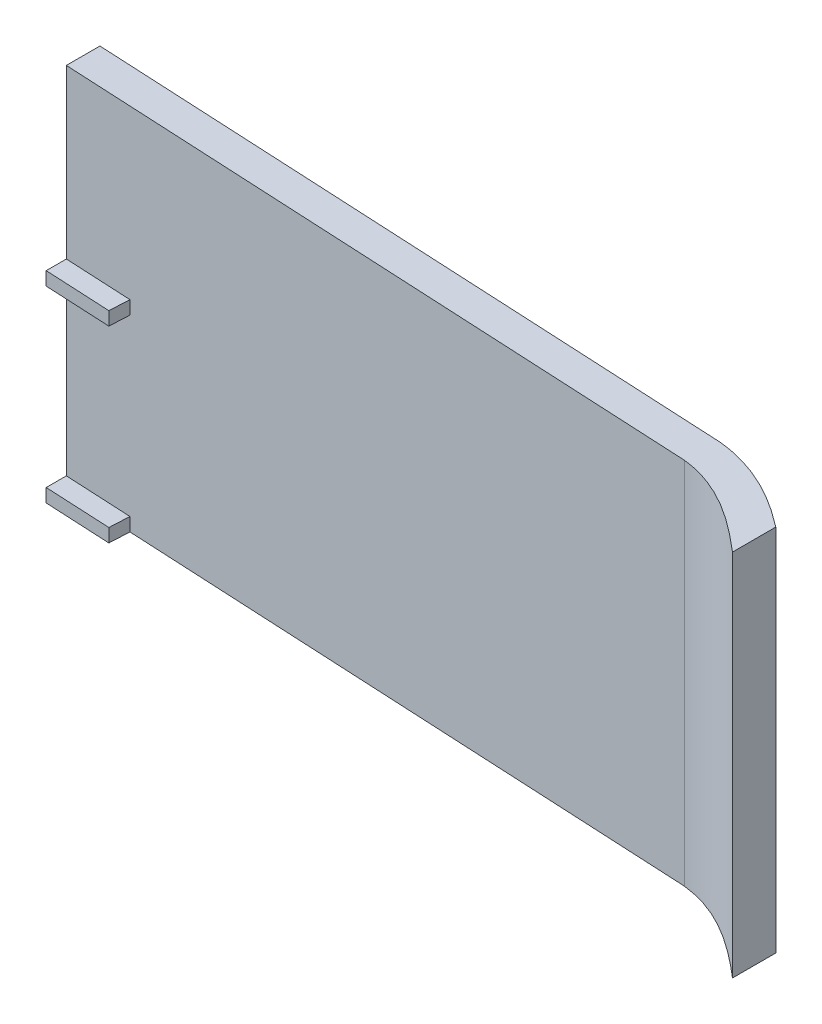
ISO-10303-21;
HEADER;
FILE_DESCRIPTION(('STEP AP214'),'2;1');
FILE_NAME('part.step','',(''),(''),'','','');
FILE_SCHEMA(('AUTOMOTIVE_DESIGN { 1 0 10303 214 1 1 1 1 }'));
ENDSEC;
DATA;
#1=APPLICATION_CONTEXT('core data for automotive mechanical design processes');
#2=APPLICATION_PROTOCOL_DEFINITION('international standard','automotive_design',2000,#1);
#3=PRODUCT_CONTEXT('',#1,'mechanical');
#4=PRODUCT('Part','Part','',(#3));
#5=PRODUCT_RELATED_PRODUCT_CATEGORY('part','',(#4));
#6=PRODUCT_DEFINITION_FORMATION('','',#4);
#7=PRODUCT_DEFINITION_CONTEXT('part definition',#1,'design');
#8=PRODUCT_DEFINITION('design','',#6,#7);
#9=PRODUCT_DEFINITION_SHAPE('','',#8);
#10=(LENGTH_UNIT() NAMED_UNIT(*) SI_UNIT(.MILLI.,.METRE.));
#11=(NAMED_UNIT(*) PLANE_ANGLE_UNIT() SI_UNIT($,.RADIAN.));
#12=(NAMED_UNIT(*) SI_UNIT($,.STERADIAN.) SOLID_ANGLE_UNIT());
#13=UNCERTAINTY_MEASURE_WITH_UNIT(LENGTH_MEASURE(1.E-05),#10,'distance_accuracy_value','');
#14=(GEOMETRIC_REPRESENTATION_CONTEXT(3) GLOBAL_UNCERTAINTY_ASSIGNED_CONTEXT((#13)) GLOBAL_UNIT_ASSIGNED_CONTEXT((#10,
#11,#12)) REPRESENTATION_CONTEXT('',''));
#15=CARTESIAN_POINT('',(0.,0.,0.));
#16=DIRECTION('',(0.,0.,1.));
#17=DIRECTION('',(1.,0.,0.));
#18=AXIS2_PLACEMENT_3D('',#15,#16,#17);
#19=CARTESIAN_POINT('',(15.2026066350711,-55.02,-53.3815975655058));
#20=DIRECTION('',(-1.,0.,0.));
#21=DIRECTION('',(0.,0.,1.));
#22=AXIS2_PLACEMENT_3D('',#19,#20,#21);
#23=PLANE('',#22);
#24=DIRECTION('',(0.,0.,-1.));
#25=VECTOR('',#24,1.);
#26=CARTESIAN_POINT('',(15.2026066350711,-55.,32.5431279620853));
#27=LINE('',#26,#25);
#28=CARTESIAN_POINT('',(15.2026066350711,-55.,-45.3713854986732));
#29=VERTEX_POINT('',#28);
#30=CARTESIAN_POINT('',(15.2026066350711,-55.,-53.3815975655058));
#31=VERTEX_POINT('',#30);
#32=EDGE_CURVE('E197',#29,#31,#27,.T.);
#33=ORIENTED_EDGE('',*,*,#32,.F.);
#34=DIRECTION('',(0.,-1.,0.));
#35=VECTOR('',#34,1.);
#36=CARTESIAN_POINT('',(15.2026066350711,0.,-45.3713854986732));
#37=LINE('',#36,#35);
#38=CARTESIAN_POINT('',(15.2026066350711,-53.,-45.3713854986732));
#39=VERTEX_POINT('',#38);
#40=EDGE_CURVE('E194',#39,#29,#37,.T.);
#41=ORIENTED_EDGE('',*,*,#40,.F.);
#42=DIRECTION('',(0.,0.,1.));
#43=VECTOR('',#42,1.);
#44=CARTESIAN_POINT('',(15.2026066350711,-53.,-46.0222081076461));
#45=LINE('',#44,#43);
#46=CARTESIAN_POINT('',(15.2026066350711,-53.,-48.3752150237354));
#47=VERTEX_POINT('',#46);
#48=EDGE_CURVE('E151',#47,#39,#45,.T.);
#49=ORIENTED_EDGE('',*,*,#48,.F.);
#50=DIRECTION('',(0.,1.,0.));
#51=VECTOR('',#50,1.);
#52=CARTESIAN_POINT('',(15.2026066350711,-55.,-48.3752150237354));
#53=LINE('',#52,#51);
#54=CARTESIAN_POINT('',(15.2026066350711,-27.,-48.3752150237354));
#55=VERTEX_POINT('',#54);
#56=EDGE_CURVE('E135',#47,#55,#53,.T.);
#57=ORIENTED_EDGE('',*,*,#56,.T.);
#58=DIRECTION('',(0.,0.,1.));
#59=VECTOR('',#58,1.);
#60=CARTESIAN_POINT('',(15.2026066350711,-27.,-46.0222081076461));
#61=LINE('',#60,#59);
#62=CARTESIAN_POINT('',(15.2026066350711,-27.,-45.3713854986732));
#63=VERTEX_POINT('',#62);
#64=EDGE_CURVE('E148',#55,#63,#61,.T.);
#65=ORIENTED_EDGE('',*,*,#64,.T.);
#66=DIRECTION('',(0.,-1.,0.));
#67=VECTOR('',#66,1.);
#68=CARTESIAN_POINT('',(15.2026066350711,0.,-45.3713854986732));
#69=LINE('',#68,#67);
#70=CARTESIAN_POINT('',(15.2026066350711,-25.,-45.3713854986732));
#71=VERTEX_POINT('',#70);
#72=EDGE_CURVE('E165',#71,#63,#69,.T.);
#73=ORIENTED_EDGE('',*,*,#72,.F.);
#74=DIRECTION('',(0.,0.,1.));
#75=VECTOR('',#74,1.);
#76=CARTESIAN_POINT('',(15.2026066350711,-25.,-46.0222081076461));
#77=LINE('',#76,#75);
#78=CARTESIAN_POINT('',(15.2026066350711,-25.,-48.3752150237354));
#79=VERTEX_POINT('',#78);
#80=EDGE_CURVE('E192',#79,#71,#77,.T.);
#81=ORIENTED_EDGE('',*,*,#80,.F.);
#82=CARTESIAN_POINT('',(15.2026066350711,0.,-48.3752150237354));
#83=VERTEX_POINT('',#82);
#84=EDGE_CURVE('E153',#79,#83,#53,.T.);
#85=ORIENTED_EDGE('',*,*,#84,.T.);
#86=DIRECTION('',(0.,0.,-1.));
#87=VECTOR('',#86,1.);
#88=CARTESIAN_POINT('',(15.2026066350711,0.,32.5431279620853));
#89=LINE('',#88,#87);
#90=CARTESIAN_POINT('',(15.2026066350711,0.,-53.3815975655058));
#91=VERTEX_POINT('',#90);
#92=EDGE_CURVE('E157',#83,#91,#89,.T.);
#93=ORIENTED_EDGE('',*,*,#92,.T.);
#94=DIRECTION('',(0.,1.,0.));
#95=VECTOR('',#94,1.);
#96=CARTESIAN_POINT('',(15.2026066350711,-55.,-53.3815975655058));
#97=LINE('',#96,#95);
#98=EDGE_CURVE('E152',#31,#91,#97,.T.);
#99=ORIENTED_EDGE('',*,*,#98,.F.);
#100=EDGE_LOOP('',(#33,#41,#49,#57,#65,#73,#81,#85,#93,#99));
#101=FACE_BOUND('',#100,.T.);
#102=ADVANCED_FACE('F37',(#101),#23,.T.);
#103=CARTESIAN_POINT('',(-77.2973933649289,-55.,-58.0568720379147));
#104=DIRECTION('',(0.0504790708541746,0.,-0.998725119042121));
#105=DIRECTION('',(-0.998725119042121,0.,-0.0504790708541746));
#106=AXIS2_PLACEMENT_3D('',#103,#104,#105);
#107=PLANE('',#106);
#108=DIRECTION('',(-0.998725119042121,0.,-0.0504790708541746));
#109=VECTOR('',#108,1.);
#110=CARTESIAN_POINT('',(-77.2973933649289,-55.,-58.0568720379147));
#111=LINE('',#110,#109);
#112=CARTESIAN_POINT('',(112.637979465165,-55.,-48.4568720379147));
#113=VERTEX_POINT('',#112);
#114=EDGE_CURVE('E166',#113,#31,#111,.T.);
#115=ORIENTED_EDGE('',*,*,#114,.T.);
#116=ORIENTED_EDGE('',*,*,#98,.T.);
#117=DIRECTION('',(-0.998725119042121,0.,-0.0504790708541746));
#118=VECTOR('',#117,1.);
#119=CARTESIAN_POINT('',(-77.2973933649289,0.,-58.0568720379147));
#120=LINE('',#119,#118);
#121=CARTESIAN_POINT('',(112.637979465165,0.,-48.4568720379147));
#122=VERTEX_POINT('',#121);
#123=EDGE_CURVE('E171',#122,#91,#120,.T.);
#124=ORIENTED_EDGE('',*,*,#123,.F.);
#125=DIRECTION('',(0.,1.,0.));
#126=VECTOR('',#125,1.);
#127=CARTESIAN_POINT('',(112.637979465165,-55.,-48.4568720379147));
#128=LINE('',#127,#126);
#129=EDGE_CURVE('E170',#113,#122,#128,.T.);
#130=ORIENTED_EDGE('',*,*,#129,.F.);
#131=EDGE_LOOP('',(#115,#116,#124,#130));
#132=FACE_BOUND('',#131,.T.);
#133=ADVANCED_FACE('F214',(#132),#107,.T.);
#134=CARTESIAN_POINT('',(142.702606635071,-55.,-29.0568720379147));
#135=CARTESIAN_POINT('',(133.287763268237,-55.,-35.7757587441815));
#136=CARTESIAN_POINT('',(125.082628435847,-55.,-47.1414686898549));
#137=CARTESIAN_POINT('',(112.637979465165,-55.,-48.4568720379147));
#138=B_SPLINE_CURVE_WITH_KNOTS('',3,(#134,#135,#136,#137),.UNSPECIFIED.,.F.,.F.,(4,4),(0.,1.),.UNSPECIFIED.);
#139=DIRECTION('',(0.,1.,0.));
#140=VECTOR('',#139,1.);
#141=SURFACE_OF_LINEAR_EXTRUSION('',#138,#140);
#142=DIRECTION('',(0.,1.,0.));
#143=VECTOR('',#142,1.);
#144=CARTESIAN_POINT('',(127.702606635071,-55.,-41.6523536542947));
#145=LINE('',#144,#143);
#146=CARTESIAN_POINT('',(127.702606635071,-55.,-41.6523536542947));
#147=VERTEX_POINT('',#146);
#148=CARTESIAN_POINT('',(127.702606630983,0.,-41.6523536574432));
#149=VERTEX_POINT('',#148);
#150=EDGE_CURVE('E164',#147,#149,#145,.T.);
#151=ORIENTED_EDGE('',*,*,#150,.F.);
#152=EDGE_CURVE('E169',#147,#113,#138,.T.);
#153=ORIENTED_EDGE('',*,*,#152,.T.);
#154=ORIENTED_EDGE('',*,*,#129,.T.);
#155=CARTESIAN_POINT('',(142.702606635071,0.,-29.0568720379147));
#156=CARTESIAN_POINT('',(133.287763268237,0.,-35.7757587441815));
#157=CARTESIAN_POINT('',(125.082628435847,0.,-47.1414686898549));
#158=CARTESIAN_POINT('',(112.637979465165,0.,-48.4568720379147));
#159=B_SPLINE_CURVE_WITH_KNOTS('',3,(#155,#156,#157,#158),.UNSPECIFIED.,.F.,.F.,(4,4),(0.,1.),.UNSPECIFIED.);
#160=EDGE_CURVE('E173',#149,#122,#159,.T.);
#161=ORIENTED_EDGE('',*,*,#160,.F.);
#162=EDGE_LOOP('',(#151,#153,#154,#161));
#163=FACE_BOUND('',#162,.T.);
#164=ADVANCED_FACE('F275',(#163),#141,.T.);
#165=CARTESIAN_POINT('',(112.240105598559,-55.,-43.4705994370284));
#166=DIRECTION('',(0.0504790708541747,0.,-0.998725119042121));
#167=DIRECTION('',(-0.998725119042121,0.,-0.0504790708541747));
#168=AXIS2_PLACEMENT_3D('',#165,#166,#167);
#169=PLANE('',#168);
#170=ORIENTED_EDGE('',*,*,#56,.F.);
#171=DIRECTION('',(0.998725119042121,0.,0.0504790708541747));
#172=VECTOR('',#171,1.);
#173=CARTESIAN_POINT('',(112.240105598559,-53.,-43.4705994370284));
#174=LINE('',#173,#172);
#175=CARTESIAN_POINT('',(25.1898578254923,-53.,-47.8704243151937));
#176=VERTEX_POINT('',#175);
#177=EDGE_CURVE('E162',#47,#176,#174,.T.);
#178=ORIENTED_EDGE('',*,*,#177,.T.);
#179=DIRECTION('',(0.,-1.,0.));
#180=VECTOR('',#179,1.);
#181=CARTESIAN_POINT('',(25.1898578254923,0.,-47.8704243151937));
#182=LINE('',#181,#180);
#183=CARTESIAN_POINT('',(25.1898578254923,-55.,-47.8704243151937));
#184=VERTEX_POINT('',#183);
#185=EDGE_CURVE('E143',#176,#184,#182,.T.);
#186=ORIENTED_EDGE('',*,*,#185,.T.);
#187=DIRECTION('',(-0.998725119042121,0.,-0.0504790708541747));
#188=VECTOR('',#187,1.);
#189=CARTESIAN_POINT('',(112.240105598559,-55.,-43.4705994370284));
#190=LINE('',#189,#188);
#191=CARTESIAN_POINT('',(112.240105598559,-55.,-43.4705994370284));
#192=VERTEX_POINT('',#191);
#193=EDGE_CURVE('E241',#192,#184,#190,.T.);
#194=ORIENTED_EDGE('',*,*,#193,.F.);
#195=DIRECTION('',(0.,1.,0.));
#196=VECTOR('',#195,1.);
#197=CARTESIAN_POINT('',(112.240105598559,-55.,-43.4705994370284));
#198=LINE('',#197,#196);
#199=CARTESIAN_POINT('',(112.240105598559,0.,-43.4705994370284));
#200=VERTEX_POINT('',#199);
#201=EDGE_CURVE('E248',#192,#200,#198,.T.);
#202=ORIENTED_EDGE('',*,*,#201,.T.);
#203=DIRECTION('',(-0.998725119042121,0.,-0.0504790708541747));
#204=VECTOR('',#203,1.);
#205=CARTESIAN_POINT('',(112.240105598559,0.,-43.4705994370284));
#206=LINE('',#205,#204);
#207=EDGE_CURVE('E208',#200,#83,#206,.T.);
#208=ORIENTED_EDGE('',*,*,#207,.T.);
#209=ORIENTED_EDGE('',*,*,#84,.F.);
#210=DIRECTION('',(0.998725119042121,0.,0.0504790708541744));
#211=VECTOR('',#210,1.);
#212=CARTESIAN_POINT('',(5.21535544464988,-25.,-48.8800057322772));
#213=LINE('',#212,#211);
#214=CARTESIAN_POINT('',(25.1898578254923,-25.,-47.8704243151937));
#215=VERTEX_POINT('',#214);
#216=EDGE_CURVE('E179',#79,#215,#213,.T.);
#217=ORIENTED_EDGE('',*,*,#216,.T.);
#218=DIRECTION('',(0.,-1.,0.));
#219=VECTOR('',#218,1.);
#220=CARTESIAN_POINT('',(25.1898578254923,-25.,-47.8704243151937));
#221=LINE('',#220,#219);
#222=CARTESIAN_POINT('',(25.1898578254923,-27.,-47.8704243151937));
#223=VERTEX_POINT('',#222);
#224=EDGE_CURVE('E139',#215,#223,#221,.T.);
#225=ORIENTED_EDGE('',*,*,#224,.T.);
#226=DIRECTION('',(0.998725119042121,0.,0.0504790708541744));
#227=VECTOR('',#226,1.);
#228=CARTESIAN_POINT('',(5.21535544464988,-27.,-48.8800057322772));
#229=LINE('',#228,#227);
#230=EDGE_CURVE('E132',#55,#223,#229,.T.);
#231=ORIENTED_EDGE('',*,*,#230,.F.);
#232=EDGE_LOOP('',(#170,#178,#186,#194,#202,#208,#209,#217,#225,#231));
#233=FACE_BOUND('',#232,.T.);
#234=ADVANCED_FACE('F134',(#233),#169,.F.);
#235=CARTESIAN_POINT('',(25.0384206129298,-25.,-44.8742489580673));
#236=DIRECTION('',(0.998725119042121,0.,0.0504790708541747));
#237=DIRECTION('',(0.0504790708541747,0.,-0.998725119042121));
#238=AXIS2_PLACEMENT_3D('',#235,#236,#237);
#239=PLANE('',#238);
#240=ORIENTED_EDGE('',*,*,#224,.F.);
#241=DIRECTION('',(0.0504790708541747,0.,-0.998725119042121));
#242=VECTOR('',#241,1.);
#243=CARTESIAN_POINT('',(25.0384206129298,-25.,-44.8742489580673));
#244=LINE('',#243,#242);
#245=CARTESIAN_POINT('',(25.0384206129298,-25.,-44.8742489580673));
#246=VERTEX_POINT('',#245);
#247=EDGE_CURVE('E48',#246,#215,#244,.T.);
#248=ORIENTED_EDGE('',*,*,#247,.F.);
#249=DIRECTION('',(0.,-1.,0.));
#250=VECTOR('',#249,1.);
#251=CARTESIAN_POINT('',(25.0384206129298,-25.,-44.8742489580673));
#252=LINE('',#251,#250);
#253=CARTESIAN_POINT('',(25.0384206129298,-27.,-44.8742489580673));
#254=VERTEX_POINT('',#253);
#255=EDGE_CURVE('E181',#246,#254,#252,.T.);
#256=ORIENTED_EDGE('',*,*,#255,.T.);
#257=DIRECTION('',(0.0504790708541747,0.,-0.998725119042121));
#258=VECTOR('',#257,1.);
#259=CARTESIAN_POINT('',(25.0384206129298,-27.,-44.8742489580673));
#260=LINE('',#259,#258);
#261=EDGE_CURVE('E11',#254,#223,#260,.T.);
#262=ORIENTED_EDGE('',*,*,#261,.T.);
#263=EDGE_LOOP('',(#240,#248,#256,#262));
#264=FACE_BOUND('',#263,.T.);
#265=ADVANCED_FACE('F349',(#264),#239,.T.);
#266=CARTESIAN_POINT('',(2.32612383491424,-27.,-46.0222081076461));
#267=DIRECTION('',(0.,1.,0.));
#268=DIRECTION('',(0.,0.,1.));
#269=AXIS2_PLACEMENT_3D('',#266,#267,#268);
#270=PLANE('',#269);
#271=ORIENTED_EDGE('',*,*,#64,.F.);
#272=ORIENTED_EDGE('',*,*,#230,.T.);
#273=ORIENTED_EDGE('',*,*,#261,.F.);
#274=DIRECTION('',(0.998725119042121,0.,0.0504790708541744));
#275=VECTOR('',#274,1.);
#276=CARTESIAN_POINT('',(5.06391823208736,-27.,-45.8838303751508));
#277=LINE('',#276,#275);
#278=EDGE_CURVE('E156',#63,#254,#277,.T.);
#279=ORIENTED_EDGE('',*,*,#278,.F.);
#280=EDGE_LOOP('',(#271,#272,#273,#279));
#281=FACE_BOUND('',#280,.T.);
#282=ADVANCED_FACE('F155',(#281),#270,.F.);
#283=CARTESIAN_POINT('',(2.32612383491424,-25.,-46.0222081076461));
#284=DIRECTION('',(0.,1.,0.));
#285=DIRECTION('',(0.,0.,1.));
#286=AXIS2_PLACEMENT_3D('',#283,#284,#285);
#287=PLANE('',#286);
#288=ORIENTED_EDGE('',*,*,#216,.F.);
#289=ORIENTED_EDGE('',*,*,#80,.T.);
#290=DIRECTION('',(0.998725119042121,0.,0.0504790708541744));
#291=VECTOR('',#290,1.);
#292=CARTESIAN_POINT('',(5.06391823208735,-25.,-45.8838303751508));
#293=LINE('',#292,#291);
#294=EDGE_CURVE('E56',#71,#246,#293,.T.);
#295=ORIENTED_EDGE('',*,*,#294,.T.);
#296=ORIENTED_EDGE('',*,*,#247,.T.);
#297=EDGE_LOOP('',(#288,#289,#295,#296));
#298=FACE_BOUND('',#297,.T.);
#299=ADVANCED_FACE('F343',(#298),#287,.T.);
#300=CARTESIAN_POINT('',(2.32612383491424,0.,-46.0222081076461));
#301=DIRECTION('',(-0.0504790708541747,0.,0.998725119042121));
#302=DIRECTION('',(0.998725119042121,0.,0.0504790708541747));
#303=AXIS2_PLACEMENT_3D('',#300,#301,#302);
#304=PLANE('',#303);
#305=ORIENTED_EDGE('',*,*,#294,.F.);
#306=ORIENTED_EDGE('',*,*,#72,.T.);
#307=ORIENTED_EDGE('',*,*,#278,.T.);
#308=ORIENTED_EDGE('',*,*,#255,.F.);
#309=EDGE_LOOP('',(#305,#306,#307,#308));
#310=FACE_BOUND('',#309,.T.);
#311=ADVANCED_FACE('F340',(#310),#304,.T.);
#312=CARTESIAN_POINT('',(25.0384206129298,0.,-44.8742489580674));
#313=DIRECTION('',(0.998725119042121,0.,0.0504790708541747));
#314=DIRECTION('',(0.0504790708541747,0.,-0.998725119042121));
#315=AXIS2_PLACEMENT_3D('',#312,#313,#314);
#316=PLANE('',#315);
#317=ORIENTED_EDGE('',*,*,#185,.F.);
#318=DIRECTION('',(0.0504790708541747,0.,-0.998725119042121));
#319=VECTOR('',#318,1.);
#320=CARTESIAN_POINT('',(25.0384206129298,-53.,-44.8742489580674));
#321=LINE('',#320,#319);
#322=CARTESIAN_POINT('',(25.0384206129298,-53.,-44.8742489580674));
#323=VERTEX_POINT('',#322);
#324=EDGE_CURVE('E231',#323,#176,#321,.T.);
#325=ORIENTED_EDGE('',*,*,#324,.F.);
#326=DIRECTION('',(0.,-1.,0.));
#327=VECTOR('',#326,1.);
#328=CARTESIAN_POINT('',(25.0384206129298,0.,-44.8742489580674));
#329=LINE('',#328,#327);
#330=CARTESIAN_POINT('',(25.0384206129298,-55.,-44.8742489580674));
#331=VERTEX_POINT('',#330);
#332=EDGE_CURVE('E177',#323,#331,#329,.T.);
#333=ORIENTED_EDGE('',*,*,#332,.T.);
#334=DIRECTION('',(0.0504790708541747,0.,-0.998725119042121));
#335=VECTOR('',#334,1.);
#336=CARTESIAN_POINT('',(25.0384206129298,-55.,-44.8742489580674));
#337=LINE('',#336,#335);
#338=EDGE_CURVE('E221',#331,#184,#337,.T.);
#339=ORIENTED_EDGE('',*,*,#338,.T.);
#340=EDGE_LOOP('',(#317,#325,#333,#339));
#341=FACE_BOUND('',#340,.T.);
#342=ADVANCED_FACE('F234',(#341),#316,.T.);
#343=CARTESIAN_POINT('',(-115.897393364929,-55.,32.5431279620853));
#344=DIRECTION('',(0.,-1.,0.));
#345=DIRECTION('',(0.,0.,-1.));
#346=AXIS2_PLACEMENT_3D('',#343,#344,#345);
#347=PLANE('',#346);
#348=DIRECTION('',(0.998725119042121,0.,0.0504790708541747));
#349=VECTOR('',#348,1.);
#350=CARTESIAN_POINT('',(2.32612383491424,-55.,-46.0222081076461));
#351=LINE('',#350,#349);
#352=EDGE_CURVE('E174',#29,#331,#351,.T.);
#353=ORIENTED_EDGE('',*,*,#352,.F.);
#354=ORIENTED_EDGE('',*,*,#32,.T.);
#355=ORIENTED_EDGE('',*,*,#114,.F.);
#356=ORIENTED_EDGE('',*,*,#152,.F.);
#357=DIRECTION('',(0.,0.,-1.));
#358=VECTOR('',#357,1.);
#359=CARTESIAN_POINT('',(127.702606635071,-55.,32.5431279620852));
#360=LINE('',#359,#358);
#361=CARTESIAN_POINT('',(127.702606635071,-55.,-35.1992417871813));
#362=VERTEX_POINT('',#361);
#363=EDGE_CURVE('E320',#362,#147,#360,.T.);
#364=ORIENTED_EDGE('',*,*,#363,.F.);
#365=CARTESIAN_POINT('',(112.240105598559,-55.,-43.4705994370284));
#366=CARTESIAN_POINT('',(112.975983657598,-55.,-43.3873494716405));
#367=CARTESIAN_POINT('',(113.700996756133,-55.,-43.25788071378));
#368=CARTESIAN_POINT('',(115.130607863263,-55.,-42.9120988137697));
#369=CARTESIAN_POINT('',(115.836701987852,-55.,-42.6952607651859));
#370=CARTESIAN_POINT('',(117.917675895648,-55.,-41.9302804631832));
#371=CARTESIAN_POINT('',(119.227839741035,-55.,-41.2804686697156));
#372=CARTESIAN_POINT('',(121.118108696838,-55.,-40.169868377226));
#373=CARTESIAN_POINT('',(121.735559112775,-55.,-39.7767618340419));
#374=CARTESIAN_POINT('',(122.950515573389,-55.,-38.9544029982691));
#375=CARTESIAN_POINT('',(123.548827323193,-55.,-38.5245008768995));
#376=CARTESIAN_POINT('',(125.312312668487,-55.,-37.1996578765664));
#377=CARTESIAN_POINT('',(126.448165149482,-55.,-36.2691291990983));
#378=CARTESIAN_POINT('',(127.611150928472,-55.,-35.2774171684214));
#379=CARTESIAN_POINT('',(127.656893723112,-55.,-35.2383473737891));
#380=CARTESIAN_POINT('',(127.702606635071,-55.,-35.1992417871813));
#381=B_SPLINE_CURVE_WITH_KNOTS('',3,(#365,#366,#367,#368,#369,#370,#371,#372,#373,#374,#375,
#376,#377,#378,#379,#380),.UNSPECIFIED.,.F.,.F.,(4,2,2,2,2,2,2,4),(0.494878568915192,
0.557378568915192,0.619878568915192,0.744878568915192,0.807378568915192,0.869878568915192,
0.994878568915192,1.),.UNSPECIFIED.);
#382=EDGE_CURVE('E244',#362,#192,#381,.F.);
#383=ORIENTED_EDGE('',*,*,#382,.T.);
#384=ORIENTED_EDGE('',*,*,#193,.T.);
#385=ORIENTED_EDGE('',*,*,#338,.F.);
#386=EDGE_LOOP('',(#353,#354,#355,#356,#364,#383,#384,#385));
#387=FACE_BOUND('',#386,.T.);
#388=ADVANCED_FACE('F219',(#387),#347,.T.);
#389=CARTESIAN_POINT('',(2.32612383491424,-53.,-46.0222081076461));
#390=DIRECTION('',(0.,1.,0.));
#391=DIRECTION('',(0.,0.,1.));
#392=AXIS2_PLACEMENT_3D('',#389,#390,#391);
#393=PLANE('',#392);
#394=ORIENTED_EDGE('',*,*,#177,.F.);
#395=ORIENTED_EDGE('',*,*,#48,.T.);
#396=DIRECTION('',(0.998725119042121,0.,0.0504790708541747));
#397=VECTOR('',#396,1.);
#398=CARTESIAN_POINT('',(2.32612383491424,-53.,-46.0222081076461));
#399=LINE('',#398,#397);
#400=EDGE_CURVE('E176',#39,#323,#399,.T.);
#401=ORIENTED_EDGE('',*,*,#400,.T.);
#402=ORIENTED_EDGE('',*,*,#324,.T.);
#403=EDGE_LOOP('',(#394,#395,#401,#402));
#404=FACE_BOUND('',#403,.T.);
#405=ADVANCED_FACE('F230',(#404),#393,.T.);
#406=CARTESIAN_POINT('',(2.32612383491424,0.,-46.0222081076461));
#407=DIRECTION('',(-0.0504790708541747,0.,0.998725119042121));
#408=DIRECTION('',(0.998725119042121,0.,0.0504790708541747));
#409=AXIS2_PLACEMENT_3D('',#406,#407,#408);
#410=PLANE('',#409);
#411=ORIENTED_EDGE('',*,*,#400,.F.);
#412=ORIENTED_EDGE('',*,*,#40,.T.);
#413=ORIENTED_EDGE('',*,*,#352,.T.);
#414=ORIENTED_EDGE('',*,*,#332,.F.);
#415=EDGE_LOOP('',(#411,#412,#413,#414));
#416=FACE_BOUND('',#415,.T.);
#417=ADVANCED_FACE('F226',(#416),#410,.T.);
#418=CARTESIAN_POINT('',(-115.897393364929,0.,32.5431279620853));
#419=DIRECTION('',(0.,-1.,0.));
#420=DIRECTION('',(0.,0.,-1.));
#421=AXIS2_PLACEMENT_3D('',#418,#419,#420);
#422=PLANE('',#421);
#423=ORIENTED_EDGE('',*,*,#92,.F.);
#424=ORIENTED_EDGE('',*,*,#207,.F.);
#425=CARTESIAN_POINT('',(127.702606635071,0.,-35.1992417871813));
#426=CARTESIAN_POINT('',(127.656893723112,0.,-35.2383473737891));
#427=CARTESIAN_POINT('',(127.611150928472,0.,-35.2774171684214));
#428=CARTESIAN_POINT('',(126.448165149482,0.,-36.2691291990983));
#429=CARTESIAN_POINT('',(125.312312668487,0.,-37.1996578765664));
#430=CARTESIAN_POINT('',(123.548827323193,0.,-38.5245008768995));
#431=CARTESIAN_POINT('',(122.950515573389,0.,-38.9544029982691));
#432=CARTESIAN_POINT('',(121.735559112775,0.,-39.7767618340419));
#433=CARTESIAN_POINT('',(121.118108696838,0.,-40.169868377226));
#434=CARTESIAN_POINT('',(119.227839741035,0.,-41.2804686697156));
#435=CARTESIAN_POINT('',(117.917675895648,0.,-41.9302804631832));
#436=CARTESIAN_POINT('',(115.836701987852,0.,-42.6952607651859));
#437=CARTESIAN_POINT('',(115.130607863263,0.,-42.9120988137697));
#438=CARTESIAN_POINT('',(113.700996756133,0.,-43.25788071378));
#439=CARTESIAN_POINT('',(112.975983657598,0.,-43.3873494716405));
#440=CARTESIAN_POINT('',(112.240105598559,0.,-43.4705994370284));
#441=B_SPLINE_CURVE_WITH_KNOTS('',3,(#425,#426,#427,#428,#429,#430,#431,#432,#433,#434,#435,
#436,#437,#438,#439,#440),.UNSPECIFIED.,.F.,.F.,(4,2,2,2,2,2,2,4),(0.494878568915192,
0.500000000000001,0.625000000000001,0.6875,0.75,0.875,0.9375,1.),.UNSPECIFIED.);
#442=CARTESIAN_POINT('',(127.702606635071,0.,-35.1992417871813));
#443=VERTEX_POINT('',#442);
#444=EDGE_CURVE('E237',#443,#200,#441,.T.);
#445=ORIENTED_EDGE('',*,*,#444,.F.);
#446=DIRECTION('',(0.,0.,-1.));
#447=VECTOR('',#446,1.);
#448=CARTESIAN_POINT('',(127.702606635071,0.,32.5431279620852));
#449=LINE('',#448,#447);
#450=EDGE_CURVE('E299',#443,#149,#449,.T.);
#451=ORIENTED_EDGE('',*,*,#450,.T.);
#452=ORIENTED_EDGE('',*,*,#160,.T.);
#453=ORIENTED_EDGE('',*,*,#123,.T.);
#454=EDGE_LOOP('',(#423,#424,#445,#451,#452,#453));
#455=FACE_BOUND('',#454,.T.);
#456=ADVANCED_FACE('F39',(#455),#422,.F.);
#457=CARTESIAN_POINT('',(141.101445233709,-55.,-24.0568720379147));
#458=CARTESIAN_POINT('',(140.802417786529,-55.,-24.2702724590776));
#459=CARTESIAN_POINT('',(140.503390339349,-55.,-24.4836728802405));
#460=CARTESIAN_POINT('',(139.90533544499,-55.,-24.9104737225663));
#461=CARTESIAN_POINT('',(139.605845523438,-55.,-25.1232995035898));
#462=CARTESIAN_POINT('',(138.716895901917,-55.,-25.7736059483529));
#463=CARTESIAN_POINT('',(138.133845944132,-55.,-26.2190509347983));
#464=CARTESIAN_POINT('',(136.406904398457,-55.,-27.582980496736));
#465=CARTESIAN_POINT('',(135.285149487214,-55.,-28.528970645989));
#466=CARTESIAN_POINT('',(131.960359272809,-55.,-31.4172320608335));
#467=CARTESIAN_POINT('',(129.799801105874,-55.,-33.4110910696109));
#468=CARTESIAN_POINT('',(126.448165149482,-55.,-36.2691291990983));
#469=CARTESIAN_POINT('',(125.312312668487,-55.,-37.1996578765664));
#470=CARTESIAN_POINT('',(123.548827323193,-55.,-38.5245008768995));
#471=CARTESIAN_POINT('',(122.950515573389,-55.,-38.9544029982691));
#472=CARTESIAN_POINT('',(121.735559112775,-55.,-39.7767618340419));
#473=CARTESIAN_POINT('',(121.118108696838,-55.,-40.169868377226));
#474=CARTESIAN_POINT('',(119.227839741035,-55.,-41.2804686697156));
#475=CARTESIAN_POINT('',(117.917675895648,-55.,-41.9302804631832));
#476=CARTESIAN_POINT('',(115.836701987852,-55.,-42.6952607651859));
#477=CARTESIAN_POINT('',(115.130607863263,-55.,-42.9120988137697));
#478=CARTESIAN_POINT('',(113.700996756133,-55.,-43.25788071378));
#479=CARTESIAN_POINT('',(112.975983657598,-55.,-43.3873494716405));
#480=CARTESIAN_POINT('',(112.240105598559,-55.,-43.4705994370284));
#481=B_SPLINE_CURVE_WITH_KNOTS('',3,(#457,#458,#459,#460,#461,#462,#463,#464,#465,#466,#467,
#468,#469,#470,#471,#472,#473,#474,#475,#476,#477,#478,#479,#480),.UNSPECIFIED.,.F.,.F.,(4,2,2,
2,2,2,2,2,2,2,2,4),(0.,0.0312500000000001,0.0625000000000002,0.125,0.25,0.500000000000001,
0.625000000000001,0.6875,0.75,0.875,0.9375,1.),.UNSPECIFIED.);
#482=DIRECTION('',(0.,1.,0.));
#483=VECTOR('',#482,1.);
#484=SURFACE_OF_LINEAR_EXTRUSION('',#481,#483);
#485=ORIENTED_EDGE('',*,*,#444,.T.);
#486=ORIENTED_EDGE('',*,*,#201,.F.);
#487=ORIENTED_EDGE('',*,*,#382,.F.);
#488=DIRECTION('',(0.,1.,0.));
#489=VECTOR('',#488,1.);
#490=CARTESIAN_POINT('',(127.702606635071,-55.,-35.1992417871813));
#491=LINE('',#490,#489);
#492=EDGE_CURVE('E246',#362,#443,#491,.T.);
#493=ORIENTED_EDGE('',*,*,#492,.T.);
#494=EDGE_LOOP('',(#485,#486,#487,#493));
#495=FACE_BOUND('',#494,.T.);
#496=ADVANCED_FACE('F263',(#495),#484,.F.);
#497=CARTESIAN_POINT('',(127.702606635071,-55.02,-41.6523536542946));
#498=DIRECTION('',(-1.,0.,0.));
#499=DIRECTION('',(0.,0.,1.));
#500=AXIS2_PLACEMENT_3D('',#497,#498,#499);
#501=PLANE('',#500);
#502=ORIENTED_EDGE('',*,*,#450,.F.);
#503=ORIENTED_EDGE('',*,*,#492,.F.);
#504=ORIENTED_EDGE('',*,*,#363,.T.);
#505=ORIENTED_EDGE('',*,*,#150,.T.);
#506=EDGE_LOOP('',(#502,#503,#504,#505));
#507=FACE_BOUND('',#506,.T.);
#508=ADVANCED_FACE('F273',(#507),#501,.F.);
#509=CLOSED_SHELL('',(#102,#133,#164,#234,#265,#282,#299,#311,#342,#388,#405,#417,#456,#496,#508));
#510=MANIFOLD_SOLID_BREP('B2',#509);
#511=ADVANCED_BREP_SHAPE_REPRESENTATION('',(#18,#510),#14);
#512=SHAPE_DEFINITION_REPRESENTATION(#9,#511);
ENDSEC;
END-ISO-10303-21;
